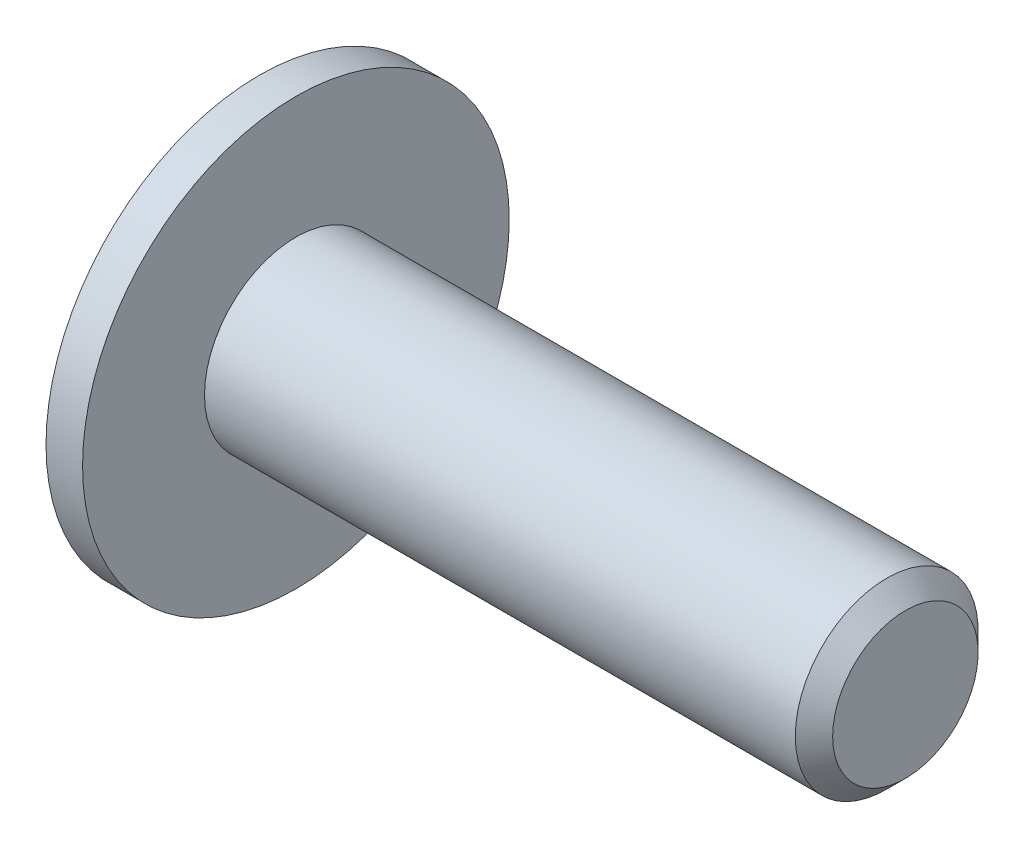
ISO-10303-21;
HEADER;
FILE_DESCRIPTION(('STEP AP214'),'2;1');
FILE_NAME('part.step','',(''),(''),'','','');
FILE_SCHEMA(('AUTOMOTIVE_DESIGN { 1 0 10303 214 1 1 1 1 }'));
ENDSEC;
DATA;
#1=APPLICATION_CONTEXT('core data for automotive mechanical design processes');
#2=APPLICATION_PROTOCOL_DEFINITION('international standard','automotive_design',2000,#1);
#3=PRODUCT_CONTEXT('',#1,'mechanical');
#4=PRODUCT('Part','Part','',(#3));
#5=PRODUCT_RELATED_PRODUCT_CATEGORY('part','',(#4));
#6=PRODUCT_DEFINITION_FORMATION('','',#4);
#7=PRODUCT_DEFINITION_CONTEXT('part definition',#1,'design');
#8=PRODUCT_DEFINITION('design','',#6,#7);
#9=PRODUCT_DEFINITION_SHAPE('','',#8);
#10=(LENGTH_UNIT() NAMED_UNIT(*) SI_UNIT(.MILLI.,.METRE.));
#11=(NAMED_UNIT(*) PLANE_ANGLE_UNIT() SI_UNIT($,.RADIAN.));
#12=(NAMED_UNIT(*) SI_UNIT($,.STERADIAN.) SOLID_ANGLE_UNIT());
#13=UNCERTAINTY_MEASURE_WITH_UNIT(LENGTH_MEASURE(1.E-05),#10,'distance_accuracy_value','');
#14=(GEOMETRIC_REPRESENTATION_CONTEXT(3) GLOBAL_UNCERTAINTY_ASSIGNED_CONTEXT((#13)) GLOBAL_UNIT_ASSIGNED_CONTEXT((#10,
#11,#12)) REPRESENTATION_CONTEXT('',''));
#15=CARTESIAN_POINT('',(0.,0.,0.));
#16=DIRECTION('',(0.,0.,1.));
#17=DIRECTION('',(1.,0.,0.));
#18=AXIS2_PLACEMENT_3D('',#15,#16,#17);
#19=CARTESIAN_POINT('',(-1.65,0.,0.));
#20=DIRECTION('',(1.,0.,0.));
#21=DIRECTION('',(0.,0.,-1.));
#22=AXIS2_PLACEMENT_3D('',#19,#20,#21);
#23=PLANE('',#22);
#24=CARTESIAN_POINT('',(-1.65,0.,0.));
#25=DIRECTION('',(-1.,0.,0.));
#26=DIRECTION('',(0.,0.,1.));
#27=AXIS2_PLACEMENT_3D('',#24,#25,#26);
#28=CIRCLE('',#27,1.95);
#29=CARTESIAN_POINT('',(-1.65,0.,1.95));
#30=VERTEX_POINT('',#29);
#31=EDGE_CURVE('E11',#30,#30,#28,.T.);
#32=ORIENTED_EDGE('',*,*,#31,.T.);
#33=EDGE_LOOP('',(#32));
#34=FACE_BOUND('',#33,.T.);
#35=DIRECTION('',(0.,-1.,0.));
#36=VECTOR('',#35,1.);
#37=CARTESIAN_POINT('',(-1.65,0.57735026918963,1.));
#38=LINE('',#37,#36);
#39=CARTESIAN_POINT('',(-1.65,0.57735026918963,1.));
#40=VERTEX_POINT('',#39);
#41=CARTESIAN_POINT('',(-1.65,-0.57735026918963,1.));
#42=VERTEX_POINT('',#41);
#43=EDGE_CURVE('E52',#40,#42,#38,.T.);
#44=ORIENTED_EDGE('',*,*,#43,.T.);
#45=DIRECTION('',(0.,-0.500000000000029,-0.866025403784422));
#46=VECTOR('',#45,1.);
#47=CARTESIAN_POINT('',(-1.65,-0.57735026918963,1.));
#48=LINE('',#47,#46);
#49=CARTESIAN_POINT('',(-1.65,-1.1547005383793,0.));
#50=VERTEX_POINT('',#49);
#51=EDGE_CURVE('E123',#42,#50,#48,.T.);
#52=ORIENTED_EDGE('',*,*,#51,.T.);
#53=DIRECTION('',(0.,0.500000000000029,-0.866025403784422));
#54=VECTOR('',#53,1.);
#55=CARTESIAN_POINT('',(-1.65,-1.1547005383793,0.));
#56=LINE('',#55,#54);
#57=CARTESIAN_POINT('',(-1.65,-0.57735026918963,-1.));
#58=VERTEX_POINT('',#57);
#59=EDGE_CURVE('E126',#50,#58,#56,.T.);
#60=ORIENTED_EDGE('',*,*,#59,.T.);
#61=DIRECTION('',(0.,1.,0.));
#62=VECTOR('',#61,1.);
#63=CARTESIAN_POINT('',(-1.65,-0.57735026918963,-1.));
#64=LINE('',#63,#62);
#65=CARTESIAN_POINT('',(-1.65,0.57735026918963,-1.));
#66=VERTEX_POINT('',#65);
#67=EDGE_CURVE('E129',#58,#66,#64,.T.);
#68=ORIENTED_EDGE('',*,*,#67,.T.);
#69=DIRECTION('',(0.,0.500000000000029,0.866025403784422));
#70=VECTOR('',#69,1.);
#71=CARTESIAN_POINT('',(-1.65,0.57735026918963,-1.));
#72=LINE('',#71,#70);
#73=CARTESIAN_POINT('',(-1.65,1.1547005383793,0.));
#74=VERTEX_POINT('',#73);
#75=EDGE_CURVE('E113',#66,#74,#72,.T.);
#76=ORIENTED_EDGE('',*,*,#75,.T.);
#77=DIRECTION('',(0.,-0.500000000000029,0.866025403784422));
#78=VECTOR('',#77,1.);
#79=CARTESIAN_POINT('',(-1.65,1.1547005383793,0.));
#80=LINE('',#79,#78);
#81=EDGE_CURVE('E132',#74,#40,#80,.T.);
#82=ORIENTED_EDGE('',*,*,#81,.T.);
#83=EDGE_LOOP('',(#44,#52,#60,#68,#76,#82));
#84=FACE_BOUND('',#83,.T.);
#85=ADVANCED_FACE('F38',(#34,#84),#23,.F.);
#86=CARTESIAN_POINT('',(-0.27250139549985,0.,0.));
#87=DIRECTION('',(-1.,0.,0.));
#88=DIRECTION('',(0.,0.,1.));
#89=AXIS2_PLACEMENT_3D('',#86,#87,#88);
#90=DEGENERATE_TOROIDAL_SURFACE('',#89,0.897886869653605,1.73333333333411,.T.);
#91=ORIENTED_EDGE('',*,*,#31,.F.);
#92=EDGE_LOOP('',(#91));
#93=FACE_BOUND('',#92,.T.);
#94=CARTESIAN_POINT('',(-0.6,0.,0.));
#95=DIRECTION('',(-1.,0.,0.));
#96=DIRECTION('',(0.,0.,1.));
#97=AXIS2_PLACEMENT_3D('',#94,#95,#96);
#98=CIRCLE('',#97,2.6);
#99=CARTESIAN_POINT('',(-0.6,0.,2.6));
#100=VERTEX_POINT('',#99);
#101=EDGE_CURVE('E45',#100,#100,#98,.T.);
#102=ORIENTED_EDGE('',*,*,#101,.T.);
#103=EDGE_LOOP('',(#102));
#104=FACE_BOUND('',#103,.T.);
#105=ADVANCED_FACE('F160',(#93,#104),#90,.T.);
#106=CARTESIAN_POINT('',(-0.6,2.6,0.));
#107=DIRECTION('',(1.,0.,0.));
#108=DIRECTION('',(0.,0.,-1.));
#109=AXIS2_PLACEMENT_3D('',#106,#107,#108);
#110=PLANE('',#109);
#111=ORIENTED_EDGE('',*,*,#101,.F.);
#112=EDGE_LOOP('',(#111));
#113=FACE_BOUND('',#112,.T.);
#114=CARTESIAN_POINT('',(-0.6,0.,0.));
#115=DIRECTION('',(-1.,0.,0.));
#116=DIRECTION('',(0.,0.,1.));
#117=AXIS2_PLACEMENT_3D('',#114,#115,#116);
#118=CIRCLE('',#117,3.5);
#119=CARTESIAN_POINT('',(-0.6,0.,3.5));
#120=VERTEX_POINT('',#119);
#121=EDGE_CURVE('E155',#120,#120,#118,.T.);
#122=ORIENTED_EDGE('',*,*,#121,.T.);
#123=EDGE_LOOP('',(#122));
#124=FACE_BOUND('',#123,.T.);
#125=ADVANCED_FACE('F162',(#113,#124),#110,.F.);
#126=CARTESIAN_POINT('',(10.,0.,0.));
#127=DIRECTION('',(-1.,0.,0.));
#128=DIRECTION('',(0.,0.,1.));
#129=AXIS2_PLACEMENT_3D('',#126,#127,#128);
#130=CYLINDRICAL_SURFACE('',#129,3.5);
#131=ORIENTED_EDGE('',*,*,#121,.F.);
#132=EDGE_LOOP('',(#131));
#133=FACE_BOUND('',#132,.T.);
#134=CARTESIAN_POINT('',(0.,0.,0.));
#135=DIRECTION('',(-1.,0.,0.));
#136=DIRECTION('',(0.,0.,1.));
#137=AXIS2_PLACEMENT_3D('',#134,#135,#136);
#138=CIRCLE('',#137,3.5);
#139=CARTESIAN_POINT('',(0.,0.,3.5));
#140=VERTEX_POINT('',#139);
#141=EDGE_CURVE('E152',#140,#140,#138,.T.);
#142=ORIENTED_EDGE('',*,*,#141,.T.);
#143=EDGE_LOOP('',(#142));
#144=FACE_BOUND('',#143,.T.);
#145=ADVANCED_FACE('F165',(#133,#144),#130,.T.);
#146=CARTESIAN_POINT('',(0.,3.5,0.));
#147=DIRECTION('',(-1.,0.,0.));
#148=DIRECTION('',(0.,0.,1.));
#149=AXIS2_PLACEMENT_3D('',#146,#147,#148);
#150=PLANE('',#149);
#151=ORIENTED_EDGE('',*,*,#141,.F.);
#152=EDGE_LOOP('',(#151));
#153=FACE_BOUND('',#152,.T.);
#154=CARTESIAN_POINT('',(0.,0.,0.));
#155=DIRECTION('',(-1.,0.,0.));
#156=DIRECTION('',(0.,0.,1.));
#157=AXIS2_PLACEMENT_3D('',#154,#155,#156);
#158=CIRCLE('',#157,1.5);
#159=CARTESIAN_POINT('',(0.,0.,1.5));
#160=VERTEX_POINT('',#159);
#161=EDGE_CURVE('E149',#160,#160,#158,.T.);
#162=ORIENTED_EDGE('',*,*,#161,.T.);
#163=EDGE_LOOP('',(#162));
#164=FACE_BOUND('',#163,.T.);
#165=ADVANCED_FACE('F171',(#153,#164),#150,.F.);
#166=CARTESIAN_POINT('',(10.,0.,0.));
#167=DIRECTION('',(-1.,0.,0.));
#168=DIRECTION('',(0.,0.,1.));
#169=AXIS2_PLACEMENT_3D('',#166,#167,#168);
#170=CYLINDRICAL_SURFACE('',#169,1.5);
#171=ORIENTED_EDGE('',*,*,#161,.F.);
#172=EDGE_LOOP('',(#171));
#173=FACE_BOUND('',#172,.T.);
#174=CARTESIAN_POINT('',(9.6935,0.,0.));
#175=DIRECTION('',(-1.,0.,0.));
#176=DIRECTION('',(0.,0.,1.));
#177=AXIS2_PLACEMENT_3D('',#174,#175,#176);
#178=CIRCLE('',#177,1.5);
#179=CARTESIAN_POINT('',(9.6935,0.,1.5));
#180=VERTEX_POINT('',#179);
#181=EDGE_CURVE('E146',#180,#180,#178,.T.);
#182=ORIENTED_EDGE('',*,*,#181,.T.);
#183=EDGE_LOOP('',(#182));
#184=FACE_BOUND('',#183,.T.);
#185=ADVANCED_FACE('F177',(#173,#184),#170,.T.);
#186=CARTESIAN_POINT('',(10.,0.,0.));
#187=DIRECTION('',(-1.,0.,0.));
#188=DIRECTION('',(0.,0.,1.));
#189=AXIS2_PLACEMENT_3D('',#186,#187,#188);
#190=CONICAL_SURFACE('',#189,1.1935,0.785398163397449);
#191=ORIENTED_EDGE('',*,*,#181,.F.);
#192=EDGE_LOOP('',(#191));
#193=FACE_BOUND('',#192,.T.);
#194=CARTESIAN_POINT('',(10.,0.,0.));
#195=DIRECTION('',(-1.,0.,0.));
#196=DIRECTION('',(0.,0.,1.));
#197=AXIS2_PLACEMENT_3D('',#194,#195,#196);
#198=CIRCLE('',#197,1.1935);
#199=CARTESIAN_POINT('',(10.,0.,1.1935));
#200=VERTEX_POINT('',#199);
#201=EDGE_CURVE('E143',#200,#200,#198,.T.);
#202=ORIENTED_EDGE('',*,*,#201,.T.);
#203=EDGE_LOOP('',(#202));
#204=FACE_BOUND('',#203,.T.);
#205=ADVANCED_FACE('F183',(#193,#204),#190,.T.);
#206=CARTESIAN_POINT('',(10.,1.1935,0.));
#207=DIRECTION('',(-1.,0.,0.));
#208=DIRECTION('',(0.,0.,1.));
#209=AXIS2_PLACEMENT_3D('',#206,#207,#208);
#210=PLANE('',#209);
#211=ORIENTED_EDGE('',*,*,#201,.F.);
#212=EDGE_LOOP('',(#211));
#213=FACE_BOUND('',#212,.T.);
#214=ADVANCED_FACE('F189',(#213),#210,.F.);
#215=CARTESIAN_POINT('',(-0.6,0.57735026918963,1.));
#216=DIRECTION('',(0.,0.,-1.));
#217=DIRECTION('',(-1.,0.,0.));
#218=AXIS2_PLACEMENT_3D('',#215,#216,#217);
#219=PLANE('',#218);
#220=ORIENTED_EDGE('',*,*,#43,.F.);
#221=DIRECTION('',(-1.,0.,0.));
#222=VECTOR('',#221,1.);
#223=CARTESIAN_POINT('',(-0.6,0.57735026918963,1.));
#224=LINE('',#223,#222);
#225=CARTESIAN_POINT('',(-0.6,0.57735026918963,1.));
#226=VERTEX_POINT('',#225);
#227=EDGE_CURVE('E118',#226,#40,#224,.T.);
#228=ORIENTED_EDGE('',*,*,#227,.F.);
#229=DIRECTION('',(0.,-1.,0.));
#230=VECTOR('',#229,1.);
#231=CARTESIAN_POINT('',(-0.6,0.57735026918963,1.));
#232=LINE('',#231,#230);
#233=CARTESIAN_POINT('',(-0.6,-0.57735026918963,1.));
#234=VERTEX_POINT('',#233);
#235=EDGE_CURVE('E135',#226,#234,#232,.T.);
#236=ORIENTED_EDGE('',*,*,#235,.T.);
#237=DIRECTION('',(-1.,0.,0.));
#238=VECTOR('',#237,1.);
#239=CARTESIAN_POINT('',(-0.6,-0.57735026918963,1.));
#240=LINE('',#239,#238);
#241=EDGE_CURVE('E141',#234,#42,#240,.T.);
#242=ORIENTED_EDGE('',*,*,#241,.T.);
#243=EDGE_LOOP('',(#220,#228,#236,#242));
#244=FACE_BOUND('',#243,.T.);
#245=ADVANCED_FACE('F194',(#244),#219,.T.);
#246=CARTESIAN_POINT('',(-0.6,-0.57735026918963,1.));
#247=DIRECTION('',(0.,0.866025403784422,-0.500000000000029));
#248=DIRECTION('',(0.,0.500000000000029,0.866025403784422));
#249=AXIS2_PLACEMENT_3D('',#246,#247,#248);
#250=PLANE('',#249);
#251=ORIENTED_EDGE('',*,*,#51,.F.);
#252=ORIENTED_EDGE('',*,*,#241,.F.);
#253=DIRECTION('',(0.,-0.500000000000029,-0.866025403784422));
#254=VECTOR('',#253,1.);
#255=CARTESIAN_POINT('',(-0.6,-0.57735026918963,1.));
#256=LINE('',#255,#254);
#257=CARTESIAN_POINT('',(-0.6,-1.1547005383793,0.));
#258=VERTEX_POINT('',#257);
#259=EDGE_CURVE('E91',#234,#258,#256,.T.);
#260=ORIENTED_EDGE('',*,*,#259,.T.);
#261=DIRECTION('',(-1.,0.,0.));
#262=VECTOR('',#261,1.);
#263=CARTESIAN_POINT('',(-0.6,-1.1547005383793,0.));
#264=LINE('',#263,#262);
#265=EDGE_CURVE('E139',#258,#50,#264,.T.);
#266=ORIENTED_EDGE('',*,*,#265,.T.);
#267=EDGE_LOOP('',(#251,#252,#260,#266));
#268=FACE_BOUND('',#267,.T.);
#269=ADVANCED_FACE('F199',(#268),#250,.T.);
#270=CARTESIAN_POINT('',(-0.6,-1.1547005383793,0.));
#271=DIRECTION('',(0.,0.866025403784422,0.500000000000029));
#272=DIRECTION('',(0.,-0.500000000000029,0.866025403784422));
#273=AXIS2_PLACEMENT_3D('',#270,#271,#272);
#274=PLANE('',#273);
#275=ORIENTED_EDGE('',*,*,#59,.F.);
#276=ORIENTED_EDGE('',*,*,#265,.F.);
#277=DIRECTION('',(0.,0.500000000000029,-0.866025403784422));
#278=VECTOR('',#277,1.);
#279=CARTESIAN_POINT('',(-0.6,-1.1547005383793,0.));
#280=LINE('',#279,#278);
#281=CARTESIAN_POINT('',(-0.6,-0.57735026918963,-1.));
#282=VERTEX_POINT('',#281);
#283=EDGE_CURVE('E109',#258,#282,#280,.T.);
#284=ORIENTED_EDGE('',*,*,#283,.T.);
#285=DIRECTION('',(-1.,0.,0.));
#286=VECTOR('',#285,1.);
#287=CARTESIAN_POINT('',(-0.6,-0.57735026918963,-1.));
#288=LINE('',#287,#286);
#289=EDGE_CURVE('E106',#282,#58,#288,.T.);
#290=ORIENTED_EDGE('',*,*,#289,.T.);
#291=EDGE_LOOP('',(#275,#276,#284,#290));
#292=FACE_BOUND('',#291,.T.);
#293=ADVANCED_FACE('F216',(#292),#274,.T.);
#294=CARTESIAN_POINT('',(-0.6,-0.57735026918963,-1.));
#295=DIRECTION('',(0.,0.,1.));
#296=DIRECTION('',(1.,0.,0.));
#297=AXIS2_PLACEMENT_3D('',#294,#295,#296);
#298=PLANE('',#297);
#299=ORIENTED_EDGE('',*,*,#67,.F.);
#300=ORIENTED_EDGE('',*,*,#289,.F.);
#301=DIRECTION('',(0.,1.,0.));
#302=VECTOR('',#301,1.);
#303=CARTESIAN_POINT('',(-0.6,-0.57735026918963,-1.));
#304=LINE('',#303,#302);
#305=CARTESIAN_POINT('',(-0.6,0.57735026918963,-1.));
#306=VERTEX_POINT('',#305);
#307=EDGE_CURVE('E101',#282,#306,#304,.T.);
#308=ORIENTED_EDGE('',*,*,#307,.T.);
#309=DIRECTION('',(-1.,0.,0.));
#310=VECTOR('',#309,1.);
#311=CARTESIAN_POINT('',(-0.6,0.57735026918963,-1.));
#312=LINE('',#311,#310);
#313=EDGE_CURVE('E105',#306,#66,#312,.T.);
#314=ORIENTED_EDGE('',*,*,#313,.T.);
#315=EDGE_LOOP('',(#299,#300,#308,#314));
#316=FACE_BOUND('',#315,.T.);
#317=ADVANCED_FACE('F104',(#316),#298,.T.);
#318=CARTESIAN_POINT('',(-0.6,0.57735026918963,-1.));
#319=DIRECTION('',(0.,-0.866025403784422,0.500000000000029));
#320=DIRECTION('',(0.,-0.500000000000029,-0.866025403784422));
#321=AXIS2_PLACEMENT_3D('',#318,#319,#320);
#322=PLANE('',#321);
#323=ORIENTED_EDGE('',*,*,#75,.F.);
#324=ORIENTED_EDGE('',*,*,#313,.F.);
#325=DIRECTION('',(0.,0.500000000000029,0.866025403784422));
#326=VECTOR('',#325,1.);
#327=CARTESIAN_POINT('',(-0.6,0.57735026918963,-1.));
#328=LINE('',#327,#326);
#329=CARTESIAN_POINT('',(-0.6,1.1547005383793,0.));
#330=VERTEX_POINT('',#329);
#331=EDGE_CURVE('E108',#306,#330,#328,.T.);
#332=ORIENTED_EDGE('',*,*,#331,.T.);
#333=DIRECTION('',(-1.,0.,0.));
#334=VECTOR('',#333,1.);
#335=CARTESIAN_POINT('',(-0.6,1.1547005383793,0.));
#336=LINE('',#335,#334);
#337=EDGE_CURVE('E82',#330,#74,#336,.T.);
#338=ORIENTED_EDGE('',*,*,#337,.T.);
#339=EDGE_LOOP('',(#323,#324,#332,#338));
#340=FACE_BOUND('',#339,.T.);
#341=ADVANCED_FACE('F111',(#340),#322,.T.);
#342=CARTESIAN_POINT('',(-0.6,1.1547005383793,0.));
#343=DIRECTION('',(0.,-0.866025403784422,-0.500000000000029));
#344=DIRECTION('',(0.,0.500000000000029,-0.866025403784422));
#345=AXIS2_PLACEMENT_3D('',#342,#343,#344);
#346=PLANE('',#345);
#347=ORIENTED_EDGE('',*,*,#81,.F.);
#348=ORIENTED_EDGE('',*,*,#337,.F.);
#349=DIRECTION('',(0.,-0.500000000000029,0.866025403784422));
#350=VECTOR('',#349,1.);
#351=CARTESIAN_POINT('',(-0.6,1.1547005383793,0.));
#352=LINE('',#351,#350);
#353=EDGE_CURVE('E60',#330,#226,#352,.T.);
#354=ORIENTED_EDGE('',*,*,#353,.T.);
#355=ORIENTED_EDGE('',*,*,#227,.T.);
#356=EDGE_LOOP('',(#347,#348,#354,#355));
#357=FACE_BOUND('',#356,.T.);
#358=ADVANCED_FACE('F209',(#357),#346,.T.);
#359=CARTESIAN_POINT('',(-0.6,0.,0.));
#360=DIRECTION('',(1.,0.,0.));
#361=DIRECTION('',(0.,0.,-1.));
#362=AXIS2_PLACEMENT_3D('',#359,#360,#361);
#363=PLANE('',#362);
#364=ORIENTED_EDGE('',*,*,#235,.F.);
#365=ORIENTED_EDGE('',*,*,#353,.F.);
#366=ORIENTED_EDGE('',*,*,#331,.F.);
#367=ORIENTED_EDGE('',*,*,#307,.F.);
#368=ORIENTED_EDGE('',*,*,#283,.F.);
#369=ORIENTED_EDGE('',*,*,#259,.F.);
#370=EDGE_LOOP('',(#364,#365,#366,#367,#368,#369));
#371=FACE_BOUND('',#370,.T.);
#372=ADVANCED_FACE('F116',(#371),#363,.F.);
#373=CLOSED_SHELL('',(#85,#105,#125,#145,#165,#185,#205,#214,#245,#269,#293,#317,#341,#358,#372));
#374=MANIFOLD_SOLID_BREP('B2',#373);
#375=ADVANCED_BREP_SHAPE_REPRESENTATION('',(#18,#374),#14);
#376=SHAPE_DEFINITION_REPRESENTATION(#9,#375);
ENDSEC;
END-ISO-10303-21;
